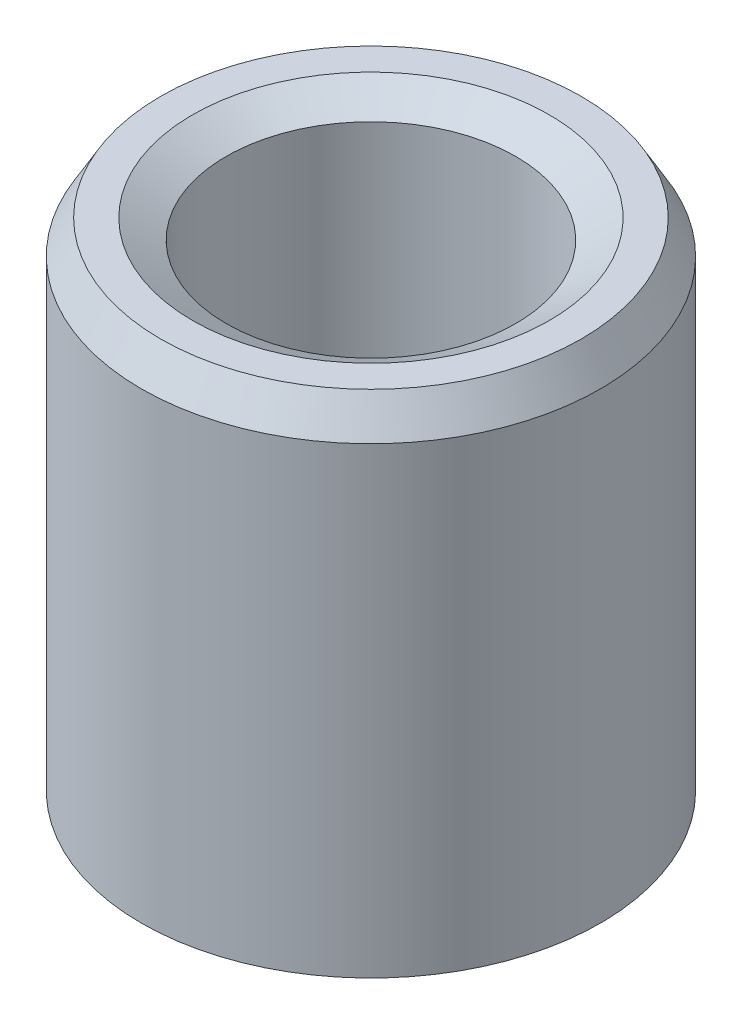
ISO-10303-21;
HEADER;
FILE_DESCRIPTION(('STEP AP214'),'2;1');
FILE_NAME('part.step','',(''),(''),'','','');
FILE_SCHEMA(('AUTOMOTIVE_DESIGN { 1 0 10303 214 1 1 1 1 }'));
ENDSEC;
DATA;
#1=APPLICATION_CONTEXT('core data for automotive mechanical design processes');
#2=APPLICATION_PROTOCOL_DEFINITION('international standard','automotive_design',2000,#1);
#3=PRODUCT_CONTEXT('',#1,'mechanical');
#4=PRODUCT('Part','Part','',(#3));
#5=PRODUCT_RELATED_PRODUCT_CATEGORY('part','',(#4));
#6=PRODUCT_DEFINITION_FORMATION('','',#4);
#7=PRODUCT_DEFINITION_CONTEXT('part definition',#1,'design');
#8=PRODUCT_DEFINITION('design','',#6,#7);
#9=PRODUCT_DEFINITION_SHAPE('','',#8);
#10=(LENGTH_UNIT() NAMED_UNIT(*) SI_UNIT(.MILLI.,.METRE.));
#11=(NAMED_UNIT(*) PLANE_ANGLE_UNIT() SI_UNIT($,.RADIAN.));
#12=(NAMED_UNIT(*) SI_UNIT($,.STERADIAN.) SOLID_ANGLE_UNIT());
#13=UNCERTAINTY_MEASURE_WITH_UNIT(LENGTH_MEASURE(1.E-05),#10,'distance_accuracy_value','');
#14=(GEOMETRIC_REPRESENTATION_CONTEXT(3) GLOBAL_UNCERTAINTY_ASSIGNED_CONTEXT((#13)) GLOBAL_UNIT_ASSIGNED_CONTEXT((#10,
#11,#12)) REPRESENTATION_CONTEXT('',''));
#15=CARTESIAN_POINT('',(0.,0.,0.));
#16=DIRECTION('',(0.,0.,1.));
#17=DIRECTION('',(1.,0.,0.));
#18=AXIS2_PLACEMENT_3D('',#15,#16,#17);
#19=CARTESIAN_POINT('',(0.,39.2980588779928,0.));
#20=DIRECTION('',(0.,-1.,0.));
#21=DIRECTION('',(0.,0.,-1.));
#22=AXIS2_PLACEMENT_3D('',#19,#20,#21);
#23=CYLINDRICAL_SURFACE('',#22,17.5);
#24=CARTESIAN_POINT('',(0.,1.47406770762273,0.));
#25=DIRECTION('',(0.,1.,0.));
#26=DIRECTION('',(0.,0.,1.));
#27=AXIS2_PLACEMENT_3D('',#24,#25,#26);
#28=CIRCLE('',#27,17.5);
#29=CARTESIAN_POINT('',(0.,1.47406770762273,17.5));
#30=VERTEX_POINT('',#29);
#31=EDGE_CURVE('E10',#30,#30,#28,.T.);
#32=ORIENTED_EDGE('',*,*,#31,.T.);
#33=EDGE_LOOP('',(#32));
#34=FACE_BOUND('',#33,.T.);
#35=CARTESIAN_POINT('',(0.,36.7448987145936,0.));
#36=DIRECTION('',(0.,1.,0.));
#37=DIRECTION('',(0.,0.,1.));
#38=AXIS2_PLACEMENT_3D('',#35,#36,#37);
#39=CIRCLE('',#38,17.5);
#40=CARTESIAN_POINT('',(0.,36.7448987145936,17.5));
#41=VERTEX_POINT('',#40);
#42=EDGE_CURVE('E50',#41,#41,#39,.F.);
#43=ORIENTED_EDGE('',*,*,#42,.T.);
#44=EDGE_LOOP('',(#43));
#45=FACE_BOUND('',#44,.T.);
#46=ADVANCED_FACE('F39',(#34,#45),#23,.T.);
#47=CARTESIAN_POINT('',(0.,39.2980588779928,0.));
#48=DIRECTION('',(0.,1.,0.));
#49=DIRECTION('',(0.,0.,1.));
#50=AXIS2_PLACEMENT_3D('',#47,#48,#49);
#51=PLANE('',#50);
#52=CARTESIAN_POINT('',(0.,39.2980588779928,0.));
#53=DIRECTION('',(0.,1.,0.));
#54=DIRECTION('',(0.,0.,1.));
#55=AXIS2_PLACEMENT_3D('',#52,#53,#54);
#56=CIRCLE('',#55,13.5922905607559);
#57=CARTESIAN_POINT('',(0.,39.2980588779928,13.5922905607559));
#58=VERTEX_POINT('',#57);
#59=EDGE_CURVE('E58',#58,#58,#56,.F.);
#60=ORIENTED_EDGE('',*,*,#59,.T.);
#61=EDGE_LOOP('',(#60));
#62=FACE_BOUND('',#61,.T.);
#63=CARTESIAN_POINT('',(0.,39.2980588779928,0.));
#64=DIRECTION('',(0.,1.,0.));
#65=DIRECTION('',(0.,0.,1.));
#66=AXIS2_PLACEMENT_3D('',#63,#64,#65);
#67=CIRCLE('',#66,16.0259322923773);
#68=CARTESIAN_POINT('',(0.,39.2980588779928,16.0259322923773));
#69=VERTEX_POINT('',#68);
#70=EDGE_CURVE('E61',#69,#69,#67,.T.);
#71=ORIENTED_EDGE('',*,*,#70,.T.);
#72=EDGE_LOOP('',(#71));
#73=FACE_BOUND('',#72,.T.);
#74=ADVANCED_FACE('F88',(#62,#73),#51,.T.);
#75=CARTESIAN_POINT('',(0.,0.,0.));
#76=DIRECTION('',(0.,1.,0.));
#77=DIRECTION('',(0.,0.,1.));
#78=AXIS2_PLACEMENT_3D('',#75,#76,#77);
#79=PLANE('',#78);
#80=CARTESIAN_POINT('',(0.,0.,0.));
#81=DIRECTION('',(0.,1.,0.));
#82=DIRECTION('',(0.,0.,1.));
#83=AXIS2_PLACEMENT_3D('',#80,#81,#82);
#84=CIRCLE('',#83,12.5131981049794);
#85=CARTESIAN_POINT('',(0.,0.,12.5131981049794));
#86=VERTEX_POINT('',#85);
#87=EDGE_CURVE('E51',#86,#86,#84,.T.);
#88=ORIENTED_EDGE('',*,*,#87,.T.);
#89=EDGE_LOOP('',(#88));
#90=FACE_BOUND('',#89,.T.);
#91=CARTESIAN_POINT('',(0.,0.,0.));
#92=DIRECTION('',(0.,1.,0.));
#93=DIRECTION('',(0.,0.,1.));
#94=AXIS2_PLACEMENT_3D('',#91,#92,#93);
#95=CIRCLE('',#94,14.9468398366008);
#96=CARTESIAN_POINT('',(0.,0.,14.9468398366008));
#97=VERTEX_POINT('',#96);
#98=EDGE_CURVE('E54',#97,#97,#95,.F.);
#99=ORIENTED_EDGE('',*,*,#98,.T.);
#100=EDGE_LOOP('',(#99));
#101=FACE_BOUND('',#100,.T.);
#102=ADVANCED_FACE('F83',(#90,#101),#79,.F.);
#103=CARTESIAN_POINT('',(0.,39.2980588779928,0.));
#104=DIRECTION('',(0.,-1.,0.));
#105=DIRECTION('',(0.,0.,-1.));
#106=AXIS2_PLACEMENT_3D('',#103,#104,#105);
#107=CYLINDRICAL_SURFACE('',#106,11.0391303973567);
#108=CARTESIAN_POINT('',(0.,37.82399117037,0.));
#109=DIRECTION('',(0.,1.,0.));
#110=DIRECTION('',(0.,0.,1.));
#111=AXIS2_PLACEMENT_3D('',#108,#109,#110);
#112=CIRCLE('',#111,11.0391303973567);
#113=CARTESIAN_POINT('',(0.,37.82399117037,11.0391303973567));
#114=VERTEX_POINT('',#113);
#115=EDGE_CURVE('E67',#114,#114,#112,.T.);
#116=ORIENTED_EDGE('',*,*,#115,.T.);
#117=EDGE_LOOP('',(#116));
#118=FACE_BOUND('',#117,.T.);
#119=CARTESIAN_POINT('',(0.,2.55316016339919,0.));
#120=DIRECTION('',(0.,1.,0.));
#121=DIRECTION('',(0.,0.,1.));
#122=AXIS2_PLACEMENT_3D('',#119,#120,#121);
#123=CIRCLE('',#122,11.0391303973567);
#124=CARTESIAN_POINT('',(0.,2.55316016339919,11.0391303973567));
#125=VERTEX_POINT('',#124);
#126=EDGE_CURVE('E69',#125,#125,#123,.F.);
#127=ORIENTED_EDGE('',*,*,#126,.T.);
#128=EDGE_LOOP('',(#127));
#129=FACE_BOUND('',#128,.T.);
#130=ADVANCED_FACE('F71',(#118,#129),#107,.F.);
#131=CARTESIAN_POINT('',(0.,37.82399117037,0.));
#132=DIRECTION('',(0.,1.,0.));
#133=DIRECTION('',(0.,0.,1.));
#134=AXIS2_PLACEMENT_3D('',#131,#132,#133);
#135=CONICAL_SURFACE('',#134,11.0391303973567,1.0471975511966);
#136=ORIENTED_EDGE('',*,*,#59,.F.);
#137=EDGE_LOOP('',(#136));
#138=FACE_BOUND('',#137,.T.);
#139=ORIENTED_EDGE('',*,*,#115,.F.);
#140=EDGE_LOOP('',(#139));
#141=FACE_BOUND('',#140,.T.);
#142=ADVANCED_FACE('F77',(#138,#141),#135,.F.);
#143=CARTESIAN_POINT('',(0.,0.,0.));
#144=DIRECTION('',(0.,-1.,0.));
#145=DIRECTION('',(0.,0.,-1.));
#146=AXIS2_PLACEMENT_3D('',#143,#144,#145);
#147=CONICAL_SURFACE('',#146,12.5131981049794,0.523598775598296);
#148=ORIENTED_EDGE('',*,*,#126,.F.);
#149=EDGE_LOOP('',(#148));
#150=FACE_BOUND('',#149,.T.);
#151=ORIENTED_EDGE('',*,*,#87,.F.);
#152=EDGE_LOOP('',(#151));
#153=FACE_BOUND('',#152,.T.);
#154=ADVANCED_FACE('F73',(#150,#153),#147,.F.);
#155=CARTESIAN_POINT('',(0.,1.47406770762273,0.));
#156=DIRECTION('',(0.,1.,0.));
#157=DIRECTION('',(0.,0.,1.));
#158=AXIS2_PLACEMENT_3D('',#155,#156,#157);
#159=CONICAL_SURFACE('',#158,17.5,1.0471975511966);
#160=ORIENTED_EDGE('',*,*,#98,.F.);
#161=EDGE_LOOP('',(#160));
#162=FACE_BOUND('',#161,.T.);
#163=ORIENTED_EDGE('',*,*,#31,.F.);
#164=EDGE_LOOP('',(#163));
#165=FACE_BOUND('',#164,.T.);
#166=ADVANCED_FACE('F76',(#162,#165),#159,.T.);
#167=CARTESIAN_POINT('',(0.,39.2980588779928,0.));
#168=DIRECTION('',(0.,-1.,0.));
#169=DIRECTION('',(0.,0.,-1.));
#170=AXIS2_PLACEMENT_3D('',#167,#168,#169);
#171=CONICAL_SURFACE('',#170,16.0259322923773,0.523598775598297);
#172=ORIENTED_EDGE('',*,*,#42,.F.);
#173=EDGE_LOOP('',(#172));
#174=FACE_BOUND('',#173,.T.);
#175=ORIENTED_EDGE('',*,*,#70,.F.);
#176=EDGE_LOOP('',(#175));
#177=FACE_BOUND('',#176,.T.);
#178=ADVANCED_FACE('F45',(#174,#177),#171,.T.);
#179=CLOSED_SHELL('',(#46,#74,#102,#130,#142,#154,#166,#178));
#180=MANIFOLD_SOLID_BREP('B2',#179);
#181=ADVANCED_BREP_SHAPE_REPRESENTATION('',(#18,#180),#14);
#182=SHAPE_DEFINITION_REPRESENTATION(#9,#181);
ENDSEC;
END-ISO-10303-21;
